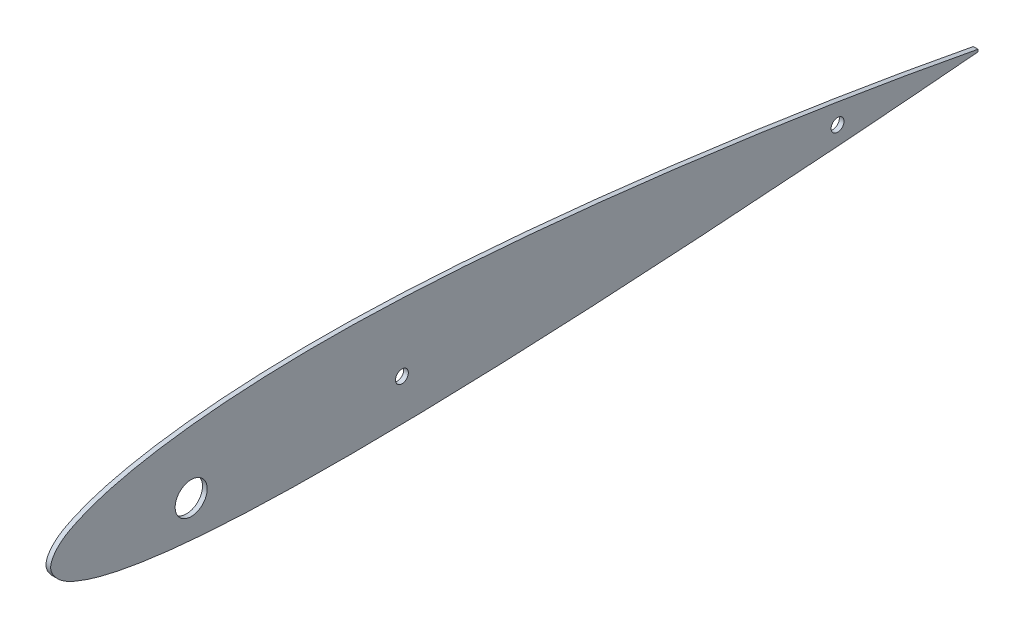
ISO-10303-21;
HEADER;
FILE_DESCRIPTION(('STEP AP214'),'2;1');
FILE_NAME('part.step','',(''),(''),'','','');
FILE_SCHEMA(('AUTOMOTIVE_DESIGN { 1 0 10303 214 1 1 1 1 }'));
ENDSEC;
DATA;
#1=APPLICATION_CONTEXT('core data for automotive mechanical design processes');
#2=APPLICATION_PROTOCOL_DEFINITION('international standard','automotive_design',2000,#1);
#3=PRODUCT_CONTEXT('',#1,'mechanical');
#4=PRODUCT('Part','Part','',(#3));
#5=PRODUCT_RELATED_PRODUCT_CATEGORY('part','',(#4));
#6=PRODUCT_DEFINITION_FORMATION('','',#4);
#7=PRODUCT_DEFINITION_CONTEXT('part definition',#1,'design');
#8=PRODUCT_DEFINITION('design','',#6,#7);
#9=PRODUCT_DEFINITION_SHAPE('','',#8);
#10=(LENGTH_UNIT() NAMED_UNIT(*) SI_UNIT(.MILLI.,.METRE.));
#11=(NAMED_UNIT(*) PLANE_ANGLE_UNIT() SI_UNIT($,.RADIAN.));
#12=(NAMED_UNIT(*) SI_UNIT($,.STERADIAN.) SOLID_ANGLE_UNIT());
#13=UNCERTAINTY_MEASURE_WITH_UNIT(LENGTH_MEASURE(1.E-05),#10,'distance_accuracy_value','');
#14=(GEOMETRIC_REPRESENTATION_CONTEXT(3) GLOBAL_UNCERTAINTY_ASSIGNED_CONTEXT((#13)) GLOBAL_UNIT_ASSIGNED_CONTEXT((#10,
#11,#12)) REPRESENTATION_CONTEXT('',''));
#15=CARTESIAN_POINT('',(0.,0.,0.));
#16=DIRECTION('',(0.,0.,1.));
#17=DIRECTION('',(1.,0.,0.));
#18=AXIS2_PLACEMENT_3D('',#15,#16,#17);
#19=CARTESIAN_POINT('',(2.,0.498957664068357,-396.008399204064));
#20=CARTESIAN_POINT('',(2.,1.73324917257407,-389.462824097327));
#21=CARTESIAN_POINT('',(2.,4.20215625721935,-376.369955319783));
#22=CARTESIAN_POINT('',(2.,8.77900567412302,-350.130346293088));
#23=CARTESIAN_POINT('',(2.,14.0370108986971,-317.273965612811));
#24=CARTESIAN_POINT('',(2.,19.5929662233102,-277.76445959175));
#25=CARTESIAN_POINT('',(2.,24.4037399033925,-238.194413225107));
#26=CARTESIAN_POINT('',(2.,28.3208764066357,-198.56394331414));
#27=CARTESIAN_POINT('',(2.,31.1952270471159,-158.827321428666));
#28=CARTESIAN_POINT('',(2.,32.3234193150525,-125.61900086419));
#29=CARTESIAN_POINT('',(2.,32.0395257163794,-99.0074858278439));
#30=CARTESIAN_POINT('',(2.,31.1729262128993,-79.044268017143));
#31=CARTESIAN_POINT('',(2.,29.4199636353484,-59.0839890938735));
#32=CARTESIAN_POINT('',(2.,27.0481870541635,-42.486203802644));
#33=CARTESIAN_POINT('',(2.,24.2275655596141,-29.2572356455919));
#34=CARTESIAN_POINT('',(2.,21.4912227728783,-19.2983873315742));
#35=CARTESIAN_POINT('',(2.,18.1647140893809,-10.9239104465409));
#36=CARTESIAN_POINT('',(2.,14.17634919189,-3.74171629045366));
#37=CARTESIAN_POINT('',(2.,6.58689480663482,2.42797287766835));
#38=CARTESIAN_POINT('',(2.,-0.563654635578988,-4.21190706297154));
#39=CARTESIAN_POINT('',(2.,-4.12388870461624,-11.5742596023716));
#40=CARTESIAN_POINT('',(2.,-6.96541864369798,-20.0561020853192));
#41=CARTESIAN_POINT('',(2.,-9.19541411840152,-30.0479044695401));
#42=CARTESIAN_POINT('',(2.,-11.4195545459523,-43.2389694781889));
#43=CARTESIAN_POINT('',(2.,-13.2285903250261,-59.6923273816749));
#44=CARTESIAN_POINT('',(2.,-14.5220357650826,-79.4128672165589));
#45=CARTESIAN_POINT('',(2.,-15.2010113058915,-99.0942889329522));
#46=CARTESIAN_POINT('',(2.,-15.5242846387084,-125.314305957217));
#47=CARTESIAN_POINT('',(2.,-15.1570321444092,-158.156003808136));
#48=CARTESIAN_POINT('',(2.,-13.8837486847356,-197.62397910927));
#49=CARTESIAN_POINT('',(2.,-11.9550708213805,-237.184466624894));
#50=CARTESIAN_POINT('',(2.,-9.58198009525624,-276.794221377206));
#51=CARTESIAN_POINT('',(2.,-6.89111674989328,-316.465196196086));
#52=CARTESIAN_POINT('',(2.,-4.40038865873363,-349.559664948341));
#53=CARTESIAN_POINT('',(2.,-2.24196380738565,-376.07614004168));
#54=CARTESIAN_POINT('',(2.,-1.08043791892812,-389.347649918621));
#55=CARTESIAN_POINT('',(2.,-0.498957664068361,-395.991600795936));
#56=B_SPLINE_CURVE_WITH_KNOTS('',3,(#19,#20,#21,#22,#23,#24,#25,#26,#27,#28,#29,#30,#31,#32,#33,
#34,#35,#36,#37,#38,#39,#40,#41,#42,#43,#44,#45,#46,#47,#48,#49,#50,#51,#52,#53,#54,#55),
.UNSPECIFIED.,.F.,.F.,(4,1,1,1,1,1,1,1,1,1,1,1,1,1,1,1,1,1,1,1,1,1,1,1,1,1,1,1,1,1,1,1,1,1,4),
(0.,0.0247583527022921,0.0495232057983208,0.099002464419805,0.148431640988793,0.197816092678823,
0.247156978041538,0.296440500967814,0.345884085447012,0.370605915917013,0.395346156344423,
0.420138805885135,0.4450560288657,0.457622030352105,0.470360866612067,0.483523326653886,
0.490626325383128,0.501772115898221,0.512907946738326,0.519977099804335,0.533052484339323,
0.545674076898575,0.558115541146016,0.58272509680566,0.607174358189599,0.631557278595084,
0.65591625667648,0.704636043070596,0.753621853029336,0.80268738739157,0.851851697592658,
0.901113053173649,0.950481472331415,0.975210155559022,1.),.UNSPECIFIED.);
#57=DIRECTION('',(-1.,0.,0.));
#58=VECTOR('',#57,1.);
#59=SURFACE_OF_LINEAR_EXTRUSION('',#56,#58);
#60=CARTESIAN_POINT('',(0.,0.498957664068357,-396.008399204064));
#61=CARTESIAN_POINT('',(0.,1.73324917257407,-389.462824097327));
#62=CARTESIAN_POINT('',(0.,4.20215625721935,-376.369955319783));
#63=CARTESIAN_POINT('',(0.,8.77900567412302,-350.130346293088));
#64=CARTESIAN_POINT('',(0.,14.0370108986971,-317.273965612811));
#65=CARTESIAN_POINT('',(0.,19.5929662233102,-277.76445959175));
#66=CARTESIAN_POINT('',(0.,24.4037399033925,-238.194413225107));
#67=CARTESIAN_POINT('',(0.,28.3208764066357,-198.56394331414));
#68=CARTESIAN_POINT('',(0.,31.1952270471159,-158.827321428666));
#69=CARTESIAN_POINT('',(0.,32.3234193150525,-125.61900086419));
#70=CARTESIAN_POINT('',(0.,32.0395257163794,-99.0074858278439));
#71=CARTESIAN_POINT('',(0.,31.1729262128993,-79.044268017143));
#72=CARTESIAN_POINT('',(0.,29.4199636353484,-59.0839890938735));
#73=CARTESIAN_POINT('',(0.,27.0481870541635,-42.486203802644));
#74=CARTESIAN_POINT('',(0.,24.2275655596141,-29.2572356455919));
#75=CARTESIAN_POINT('',(0.,21.4912227728783,-19.2983873315742));
#76=CARTESIAN_POINT('',(0.,18.1647140893809,-10.9239104465409));
#77=CARTESIAN_POINT('',(0.,14.17634919189,-3.74171629045366));
#78=CARTESIAN_POINT('',(0.,6.58689480663482,2.42797287766835));
#79=CARTESIAN_POINT('',(0.,-0.563654635578988,-4.21190706297154));
#80=CARTESIAN_POINT('',(0.,-4.12388870461624,-11.5742596023716));
#81=CARTESIAN_POINT('',(0.,-6.96541864369798,-20.0561020853192));
#82=CARTESIAN_POINT('',(0.,-9.19541411840152,-30.0479044695401));
#83=CARTESIAN_POINT('',(0.,-11.4195545459523,-43.2389694781889));
#84=CARTESIAN_POINT('',(0.,-13.2285903250261,-59.6923273816749));
#85=CARTESIAN_POINT('',(0.,-14.5220357650826,-79.4128672165589));
#86=CARTESIAN_POINT('',(0.,-15.2010113058915,-99.0942889329522));
#87=CARTESIAN_POINT('',(0.,-15.5242846387084,-125.314305957217));
#88=CARTESIAN_POINT('',(0.,-15.1570321444092,-158.156003808136));
#89=CARTESIAN_POINT('',(0.,-13.8837486847356,-197.62397910927));
#90=CARTESIAN_POINT('',(0.,-11.9550708213805,-237.184466624894));
#91=CARTESIAN_POINT('',(0.,-9.58198009525624,-276.794221377206));
#92=CARTESIAN_POINT('',(0.,-6.89111674989328,-316.465196196086));
#93=CARTESIAN_POINT('',(0.,-4.40038865873363,-349.559664948341));
#94=CARTESIAN_POINT('',(0.,-2.24196380738565,-376.07614004168));
#95=CARTESIAN_POINT('',(0.,-1.08043791892812,-389.347649918621));
#96=CARTESIAN_POINT('',(0.,-0.498957664068361,-395.991600795936));
#97=B_SPLINE_CURVE_WITH_KNOTS('',3,(#60,#61,#62,#63,#64,#65,#66,#67,#68,#69,#70,#71,#72,#73,#74,
#75,#76,#77,#78,#79,#80,#81,#82,#83,#84,#85,#86,#87,#88,#89,#90,#91,#92,#93,#94,#95,#96),
.UNSPECIFIED.,.F.,.F.,(4,1,1,1,1,1,1,1,1,1,1,1,1,1,1,1,1,1,1,1,1,1,1,1,1,1,1,1,1,1,1,1,1,1,4),
(0.,0.0247583527022921,0.0495232057983208,0.099002464419805,0.148431640988793,0.197816092678823,
0.247156978041538,0.296440500967814,0.345884085447012,0.370605915917013,0.395346156344423,
0.420138805885135,0.4450560288657,0.457622030352105,0.470360866612067,0.483523326653886,
0.490626325383128,0.501772115898221,0.512907946738326,0.519977099804335,0.533052484339323,
0.545674076898575,0.558115541146016,0.58272509680566,0.607174358189599,0.631557278595084,
0.65591625667648,0.704636043070596,0.753621853029336,0.80268738739157,0.851851697592658,
0.901113053173649,0.950481472331415,0.975210155559022,1.),.UNSPECIFIED.);
#98=CARTESIAN_POINT('',(0.,0.498957664068359,-396.008399204064));
#99=VERTEX_POINT('',#98);
#100=CARTESIAN_POINT('',(0.,-0.498957664068359,-395.991600795936));
#101=VERTEX_POINT('',#100);
#102=EDGE_CURVE('E69',#99,#101,#97,.T.);
#103=ORIENTED_EDGE('',*,*,#102,.T.);
#104=DIRECTION('',(-1.,0.,0.));
#105=VECTOR('',#104,1.);
#106=CARTESIAN_POINT('',(2.,-0.498957664068359,-395.991600795936));
#107=LINE('',#106,#105);
#108=CARTESIAN_POINT('',(2.,-0.498957664068359,-395.991600795936));
#109=VERTEX_POINT('',#108);
#110=EDGE_CURVE('E11',#109,#101,#107,.T.);
#111=ORIENTED_EDGE('',*,*,#110,.F.);
#112=CARTESIAN_POINT('',(2.,0.498957664068359,-396.008399204064));
#113=VERTEX_POINT('',#112);
#114=EDGE_CURVE('E68',#113,#109,#56,.T.);
#115=ORIENTED_EDGE('',*,*,#114,.F.);
#116=DIRECTION('',(-1.,0.,0.));
#117=VECTOR('',#116,1.);
#118=CARTESIAN_POINT('',(2.,0.498957664068359,-396.008399204064));
#119=LINE('',#118,#117);
#120=EDGE_CURVE('E45',#113,#99,#119,.T.);
#121=ORIENTED_EDGE('',*,*,#120,.T.);
#122=EDGE_LOOP('',(#103,#111,#115,#121));
#123=FACE_BOUND('',#122,.T.);
#124=ADVANCED_FACE('F35',(#123),#59,.F.);
#125=CARTESIAN_POINT('',(2.,0.498957664068359,-396.008399204064));
#126=DIRECTION('',(0.,0.0168311159332552,0.999858346735397));
#127=DIRECTION('',(0.,-0.999858346735397,0.0168311159332552));
#128=AXIS2_PLACEMENT_3D('',#125,#126,#127);
#129=PLANE('',#128);
#130=DIRECTION('',(0.,0.999858346735397,-0.0168311159332552));
#131=VECTOR('',#130,1.);
#132=CARTESIAN_POINT('',(0.,0.498957664068359,-396.008399204064));
#133=LINE('',#132,#131);
#134=EDGE_CURVE('E61',#101,#99,#133,.T.);
#135=ORIENTED_EDGE('',*,*,#134,.T.);
#136=ORIENTED_EDGE('',*,*,#120,.F.);
#137=DIRECTION('',(0.,0.999858346735397,-0.0168311159332552));
#138=VECTOR('',#137,1.);
#139=CARTESIAN_POINT('',(2.,0.498957664068359,-396.008399204064));
#140=LINE('',#139,#138);
#141=EDGE_CURVE('E53',#109,#113,#140,.T.);
#142=ORIENTED_EDGE('',*,*,#141,.F.);
#143=ORIENTED_EDGE('',*,*,#110,.T.);
#144=EDGE_LOOP('',(#135,#136,#142,#143));
#145=FACE_BOUND('',#144,.T.);
#146=ADVANCED_FACE('F64',(#145),#129,.F.);
#147=CARTESIAN_POINT('',(2.,8.00244059002986,-0.133276198651239));
#148=DIRECTION('',(-1.,0.,0.));
#149=DIRECTION('',(0.,0.,1.));
#150=AXIS2_PLACEMENT_3D('',#147,#148,#149);
#151=PLANE('',#150);
#152=CARTESIAN_POINT('',(2.,2.5000018824215,-60.));
#153=DIRECTION('',(1.,0.,0.));
#154=DIRECTION('',(0.,0.,-1.));
#155=AXIS2_PLACEMENT_3D('',#152,#153,#154);
#156=CIRCLE('',#155,6.83635541999999);
#157=CARTESIAN_POINT('',(2.,2.5000018824215,-66.83635542));
#158=VERTEX_POINT('',#157);
#159=EDGE_CURVE('E86',#158,#158,#156,.T.);
#160=ORIENTED_EDGE('',*,*,#159,.F.);
#161=EDGE_LOOP('',(#160));
#162=FACE_BOUND('',#161,.T.);
#163=CARTESIAN_POINT('',(2.,2.5000018824215,-150.));
#164=DIRECTION('',(1.,0.,0.));
#165=DIRECTION('',(0.,0.,-1.));
#166=AXIS2_PLACEMENT_3D('',#163,#164,#165);
#167=CIRCLE('',#166,2.75000000000001);
#168=CARTESIAN_POINT('',(2.,2.5000018824215,-152.75));
#169=VERTEX_POINT('',#168);
#170=EDGE_CURVE('E108',#169,#169,#167,.T.);
#171=ORIENTED_EDGE('',*,*,#170,.F.);
#172=EDGE_LOOP('',(#171));
#173=FACE_BOUND('',#172,.T.);
#174=CARTESIAN_POINT('',(2.,2.50000188242148,-336.033583382836));
#175=DIRECTION('',(1.,0.,0.));
#176=DIRECTION('',(0.,0.,-1.));
#177=AXIS2_PLACEMENT_3D('',#174,#175,#176);
#178=CIRCLE('',#177,2.75000000000004);
#179=CARTESIAN_POINT('',(2.,2.50000188242148,-338.783583382836));
#180=VERTEX_POINT('',#179);
#181=EDGE_CURVE('E106',#180,#180,#178,.T.);
#182=ORIENTED_EDGE('',*,*,#181,.F.);
#183=EDGE_LOOP('',(#182));
#184=FACE_BOUND('',#183,.T.);
#185=ORIENTED_EDGE('',*,*,#114,.T.);
#186=ORIENTED_EDGE('',*,*,#141,.T.);
#187=EDGE_LOOP('',(#185,#186));
#188=FACE_BOUND('',#187,.T.);
#189=ADVANCED_FACE('F96',(#162,#173,#184,#188),#151,.F.);
#190=CARTESIAN_POINT('',(0.,8.00244059002986,-0.133276198651239));
#191=DIRECTION('',(-1.,0.,0.));
#192=DIRECTION('',(0.,0.,1.));
#193=AXIS2_PLACEMENT_3D('',#190,#191,#192);
#194=PLANE('',#193);
#195=CARTESIAN_POINT('',(0.,2.5000018824215,-60.));
#196=DIRECTION('',(-1.,0.,0.));
#197=DIRECTION('',(0.,0.,1.));
#198=AXIS2_PLACEMENT_3D('',#195,#196,#197);
#199=CIRCLE('',#198,6.83635541999999);
#200=CARTESIAN_POINT('',(0.,2.5000018824215,-53.16364458));
#201=VERTEX_POINT('',#200);
#202=EDGE_CURVE('E39',#201,#201,#199,.T.);
#203=ORIENTED_EDGE('',*,*,#202,.F.);
#204=EDGE_LOOP('',(#203));
#205=FACE_BOUND('',#204,.T.);
#206=CARTESIAN_POINT('',(0.,2.5000018824215,-150.));
#207=DIRECTION('',(-1.,0.,0.));
#208=DIRECTION('',(0.,0.,1.));
#209=AXIS2_PLACEMENT_3D('',#206,#207,#208);
#210=CIRCLE('',#209,2.75000000000001);
#211=CARTESIAN_POINT('',(0.,2.5000018824215,-147.25));
#212=VERTEX_POINT('',#211);
#213=EDGE_CURVE('E76',#212,#212,#210,.T.);
#214=ORIENTED_EDGE('',*,*,#213,.F.);
#215=EDGE_LOOP('',(#214));
#216=FACE_BOUND('',#215,.T.);
#217=CARTESIAN_POINT('',(0.,2.50000188242148,-336.033583382836));
#218=DIRECTION('',(-1.,0.,0.));
#219=DIRECTION('',(0.,0.,1.));
#220=AXIS2_PLACEMENT_3D('',#217,#218,#219);
#221=CIRCLE('',#220,2.75000000000004);
#222=CARTESIAN_POINT('',(0.,2.50000188242148,-333.283583382836));
#223=VERTEX_POINT('',#222);
#224=EDGE_CURVE('E84',#223,#223,#221,.T.);
#225=ORIENTED_EDGE('',*,*,#224,.F.);
#226=EDGE_LOOP('',(#225));
#227=FACE_BOUND('',#226,.T.);
#228=ORIENTED_EDGE('',*,*,#102,.F.);
#229=ORIENTED_EDGE('',*,*,#134,.F.);
#230=EDGE_LOOP('',(#228,#229));
#231=FACE_BOUND('',#230,.T.);
#232=ADVANCED_FACE('F73',(#205,#216,#227,#231),#194,.T.);
#233=CARTESIAN_POINT('',(-1.2E-05,2.50000188242148,-336.033583382836));
#234=DIRECTION('',(1.,0.,0.));
#235=DIRECTION('',(0.,0.,-1.));
#236=AXIS2_PLACEMENT_3D('',#233,#234,#235);
#237=CYLINDRICAL_SURFACE('',#236,2.75000000000004);
#238=ORIENTED_EDGE('',*,*,#224,.T.);
#239=EDGE_LOOP('',(#238));
#240=FACE_BOUND('',#239,.T.);
#241=ORIENTED_EDGE('',*,*,#181,.T.);
#242=EDGE_LOOP('',(#241));
#243=FACE_BOUND('',#242,.T.);
#244=ADVANCED_FACE('F95',(#240,#243),#237,.F.);
#245=CARTESIAN_POINT('',(-1.2E-05,2.5000018824215,-150.));
#246=DIRECTION('',(1.,0.,0.));
#247=DIRECTION('',(0.,0.,-1.));
#248=AXIS2_PLACEMENT_3D('',#245,#246,#247);
#249=CYLINDRICAL_SURFACE('',#248,2.75000000000001);
#250=ORIENTED_EDGE('',*,*,#213,.T.);
#251=EDGE_LOOP('',(#250));
#252=FACE_BOUND('',#251,.T.);
#253=ORIENTED_EDGE('',*,*,#170,.T.);
#254=EDGE_LOOP('',(#253));
#255=FACE_BOUND('',#254,.T.);
#256=ADVANCED_FACE('F90',(#252,#255),#249,.F.);
#257=CARTESIAN_POINT('',(-1.2E-05,2.5000018824215,-60.));
#258=DIRECTION('',(1.,0.,0.));
#259=DIRECTION('',(0.,0.,-1.));
#260=AXIS2_PLACEMENT_3D('',#257,#258,#259);
#261=CYLINDRICAL_SURFACE('',#260,6.83635541999999);
#262=ORIENTED_EDGE('',*,*,#202,.T.);
#263=EDGE_LOOP('',(#262));
#264=FACE_BOUND('',#263,.T.);
#265=ORIENTED_EDGE('',*,*,#159,.T.);
#266=EDGE_LOOP('',(#265));
#267=FACE_BOUND('',#266,.T.);
#268=ADVANCED_FACE('F159',(#264,#267),#261,.F.);
#269=CLOSED_SHELL('',(#124,#146,#189,#232,#244,#256,#268));
#270=MANIFOLD_SOLID_BREP('B2',#269);
#271=ADVANCED_BREP_SHAPE_REPRESENTATION('',(#18,#270),#14);
#272=SHAPE_DEFINITION_REPRESENTATION(#9,#271);
ENDSEC;
END-ISO-10303-21;
